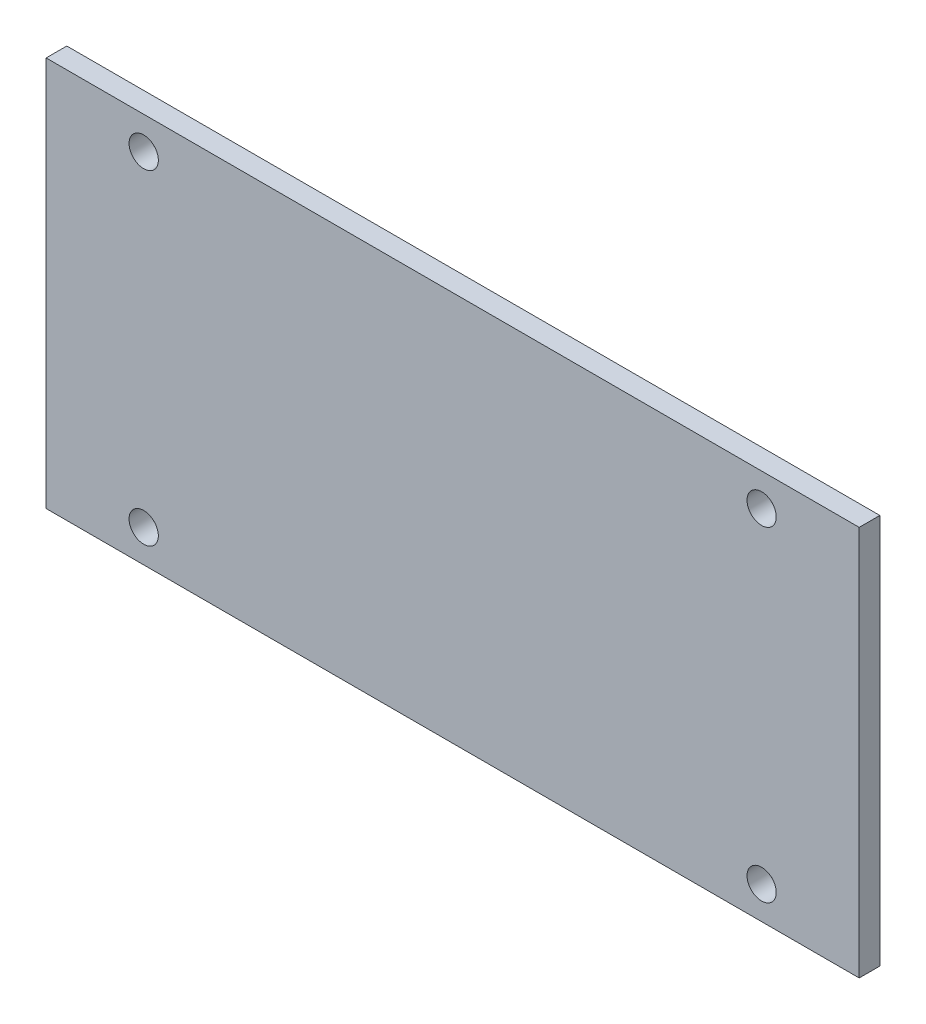
ISO-10303-21;
HEADER;
FILE_DESCRIPTION(('STEP AP214'),'2;1');
FILE_NAME('part.step','',(''),(''),'','','');
FILE_SCHEMA(('AUTOMOTIVE_DESIGN { 1 0 10303 214 1 1 1 1 }'));
ENDSEC;
DATA;
#1=APPLICATION_CONTEXT('core data for automotive mechanical design processes');
#2=APPLICATION_PROTOCOL_DEFINITION('international standard','automotive_design',2000,#1);
#3=PRODUCT_CONTEXT('',#1,'mechanical');
#4=PRODUCT('Part','Part','',(#3));
#5=PRODUCT_RELATED_PRODUCT_CATEGORY('part','',(#4));
#6=PRODUCT_DEFINITION_FORMATION('','',#4);
#7=PRODUCT_DEFINITION_CONTEXT('part definition',#1,'design');
#8=PRODUCT_DEFINITION('design','',#6,#7);
#9=PRODUCT_DEFINITION_SHAPE('','',#8);
#10=(LENGTH_UNIT() NAMED_UNIT(*) SI_UNIT(.MILLI.,.METRE.));
#11=(NAMED_UNIT(*) PLANE_ANGLE_UNIT() SI_UNIT($,.RADIAN.));
#12=(NAMED_UNIT(*) SI_UNIT($,.STERADIAN.) SOLID_ANGLE_UNIT());
#13=UNCERTAINTY_MEASURE_WITH_UNIT(LENGTH_MEASURE(1.E-05),#10,'distance_accuracy_value','');
#14=(GEOMETRIC_REPRESENTATION_CONTEXT(3) GLOBAL_UNCERTAINTY_ASSIGNED_CONTEXT((#13)) GLOBAL_UNIT_ASSIGNED_CONTEXT((#10,
#11,#12)) REPRESENTATION_CONTEXT('',''));
#15=CARTESIAN_POINT('',(0.,0.,0.));
#16=DIRECTION('',(0.,0.,1.));
#17=DIRECTION('',(1.,0.,0.));
#18=AXIS2_PLACEMENT_3D('',#15,#16,#17);
#19=CARTESIAN_POINT('',(-62.5,-30.,3.175));
#20=DIRECTION('',(1.,0.,0.));
#21=DIRECTION('',(0.,0.,-1.));
#22=AXIS2_PLACEMENT_3D('',#19,#20,#21);
#23=PLANE('',#22);
#24=DIRECTION('',(0.,-1.,0.));
#25=VECTOR('',#24,1.);
#26=CARTESIAN_POINT('',(-62.5,-30.,0.));
#27=LINE('',#26,#25);
#28=CARTESIAN_POINT('',(-62.5,30.,0.));
#29=VERTEX_POINT('',#28);
#30=CARTESIAN_POINT('',(-62.5,-30.,0.));
#31=VERTEX_POINT('',#30);
#32=EDGE_CURVE('E100',#29,#31,#27,.T.);
#33=ORIENTED_EDGE('',*,*,#32,.T.);
#34=DIRECTION('',(0.,0.,-1.));
#35=VECTOR('',#34,1.);
#36=CARTESIAN_POINT('',(-62.5,-30.,3.175));
#37=LINE('',#36,#35);
#38=CARTESIAN_POINT('',(-62.5,-30.,3.175));
#39=VERTEX_POINT('',#38);
#40=EDGE_CURVE('E11',#39,#31,#37,.T.);
#41=ORIENTED_EDGE('',*,*,#40,.F.);
#42=DIRECTION('',(0.,-1.,0.));
#43=VECTOR('',#42,1.);
#44=CARTESIAN_POINT('',(-62.5,-30.,3.175));
#45=LINE('',#44,#43);
#46=CARTESIAN_POINT('',(-62.5,30.,3.175));
#47=VERTEX_POINT('',#46);
#48=EDGE_CURVE('E88',#47,#39,#45,.T.);
#49=ORIENTED_EDGE('',*,*,#48,.F.);
#50=DIRECTION('',(0.,0.,-1.));
#51=VECTOR('',#50,1.);
#52=CARTESIAN_POINT('',(-62.5,30.,3.175));
#53=LINE('',#52,#51);
#54=EDGE_CURVE('E96',#47,#29,#53,.T.);
#55=ORIENTED_EDGE('',*,*,#54,.T.);
#56=EDGE_LOOP('',(#33,#41,#49,#55));
#57=FACE_BOUND('',#56,.T.);
#58=ADVANCED_FACE('F37',(#57),#23,.F.);
#59=CARTESIAN_POINT('',(62.5,-30.,3.175));
#60=DIRECTION('',(0.,1.,0.));
#61=DIRECTION('',(-1.,0.,0.));
#62=AXIS2_PLACEMENT_3D('',#59,#60,#61);
#63=PLANE('',#62);
#64=DIRECTION('',(1.,0.,0.));
#65=VECTOR('',#64,1.);
#66=CARTESIAN_POINT('',(62.5,-30.,0.));
#67=LINE('',#66,#65);
#68=CARTESIAN_POINT('',(62.5,-30.,0.));
#69=VERTEX_POINT('',#68);
#70=EDGE_CURVE('E92',#31,#69,#67,.T.);
#71=ORIENTED_EDGE('',*,*,#70,.T.);
#72=DIRECTION('',(0.,0.,-1.));
#73=VECTOR('',#72,1.);
#74=CARTESIAN_POINT('',(62.5,-30.,3.175));
#75=LINE('',#74,#73);
#76=CARTESIAN_POINT('',(62.5,-30.,3.175));
#77=VERTEX_POINT('',#76);
#78=EDGE_CURVE('E45',#77,#69,#75,.T.);
#79=ORIENTED_EDGE('',*,*,#78,.F.);
#80=DIRECTION('',(1.,0.,0.));
#81=VECTOR('',#80,1.);
#82=CARTESIAN_POINT('',(62.5,-30.,3.175));
#83=LINE('',#82,#81);
#84=EDGE_CURVE('E83',#39,#77,#83,.T.);
#85=ORIENTED_EDGE('',*,*,#84,.F.);
#86=ORIENTED_EDGE('',*,*,#40,.T.);
#87=EDGE_LOOP('',(#71,#79,#85,#86));
#88=FACE_BOUND('',#87,.T.);
#89=ADVANCED_FACE('F91',(#88),#63,.F.);
#90=CARTESIAN_POINT('',(62.5,-30.,3.175));
#91=DIRECTION('',(-1.,0.,0.));
#92=DIRECTION('',(0.,0.,1.));
#93=AXIS2_PLACEMENT_3D('',#90,#91,#92);
#94=PLANE('',#93);
#95=DIRECTION('',(0.,1.,0.));
#96=VECTOR('',#95,1.);
#97=CARTESIAN_POINT('',(62.5,-30.,0.));
#98=LINE('',#97,#96);
#99=CARTESIAN_POINT('',(62.5,30.,0.));
#100=VERTEX_POINT('',#99);
#101=EDGE_CURVE('E70',#69,#100,#98,.T.);
#102=ORIENTED_EDGE('',*,*,#101,.T.);
#103=DIRECTION('',(0.,0.,-1.));
#104=VECTOR('',#103,1.);
#105=CARTESIAN_POINT('',(62.5,30.,3.175));
#106=LINE('',#105,#104);
#107=CARTESIAN_POINT('',(62.5,30.,3.175));
#108=VERTEX_POINT('',#107);
#109=EDGE_CURVE('E93',#108,#100,#106,.T.);
#110=ORIENTED_EDGE('',*,*,#109,.F.);
#111=DIRECTION('',(0.,1.,0.));
#112=VECTOR('',#111,1.);
#113=CARTESIAN_POINT('',(62.5,-30.,3.175));
#114=LINE('',#113,#112);
#115=EDGE_CURVE('E86',#77,#108,#114,.T.);
#116=ORIENTED_EDGE('',*,*,#115,.F.);
#117=ORIENTED_EDGE('',*,*,#78,.T.);
#118=EDGE_LOOP('',(#102,#110,#116,#117));
#119=FACE_BOUND('',#118,.T.);
#120=ADVANCED_FACE('F94',(#119),#94,.F.);
#121=CARTESIAN_POINT('',(62.5,30.,3.175));
#122=DIRECTION('',(0.,-1.,0.));
#123=DIRECTION('',(1.,0.,0.));
#124=AXIS2_PLACEMENT_3D('',#121,#122,#123);
#125=PLANE('',#124);
#126=DIRECTION('',(-1.,0.,0.));
#127=VECTOR('',#126,1.);
#128=CARTESIAN_POINT('',(62.5,30.,0.));
#129=LINE('',#128,#127);
#130=EDGE_CURVE('E76',#100,#29,#129,.T.);
#131=ORIENTED_EDGE('',*,*,#130,.T.);
#132=ORIENTED_EDGE('',*,*,#54,.F.);
#133=DIRECTION('',(-1.,0.,0.));
#134=VECTOR('',#133,1.);
#135=CARTESIAN_POINT('',(62.5,30.,3.175));
#136=LINE('',#135,#134);
#137=EDGE_CURVE('E53',#108,#47,#136,.T.);
#138=ORIENTED_EDGE('',*,*,#137,.F.);
#139=ORIENTED_EDGE('',*,*,#109,.T.);
#140=EDGE_LOOP('',(#131,#132,#138,#139));
#141=FACE_BOUND('',#140,.T.);
#142=ADVANCED_FACE('F108',(#141),#125,.F.);
#143=CARTESIAN_POINT('',(0.,0.,3.175));
#144=DIRECTION('',(0.,0.,1.));
#145=DIRECTION('',(1.,0.,0.));
#146=AXIS2_PLACEMENT_3D('',#143,#144,#145);
#147=PLANE('',#146);
#148=CARTESIAN_POINT('',(47.5,25.,3.175));
#149=DIRECTION('',(0.,0.,1.));
#150=DIRECTION('',(-1.,0.,0.));
#151=AXIS2_PLACEMENT_3D('',#148,#149,#150);
#152=CIRCLE('',#151,2.25);
#153=CARTESIAN_POINT('',(45.25,25.,3.175));
#154=VERTEX_POINT('',#153);
#155=EDGE_CURVE('E120',#154,#154,#152,.T.);
#156=ORIENTED_EDGE('',*,*,#155,.F.);
#157=EDGE_LOOP('',(#156));
#158=FACE_BOUND('',#157,.T.);
#159=CARTESIAN_POINT('',(47.5,-25.,3.175));
#160=DIRECTION('',(0.,0.,1.));
#161=DIRECTION('',(-1.,0.,0.));
#162=AXIS2_PLACEMENT_3D('',#159,#160,#161);
#163=CIRCLE('',#162,2.25);
#164=CARTESIAN_POINT('',(45.25,-25.,3.175));
#165=VERTEX_POINT('',#164);
#166=EDGE_CURVE('E126',#165,#165,#163,.T.);
#167=ORIENTED_EDGE('',*,*,#166,.F.);
#168=EDGE_LOOP('',(#167));
#169=FACE_BOUND('',#168,.T.);
#170=CARTESIAN_POINT('',(-47.5,-25.,3.175));
#171=DIRECTION('',(0.,0.,1.));
#172=DIRECTION('',(1.,0.,0.));
#173=AXIS2_PLACEMENT_3D('',#170,#171,#172);
#174=CIRCLE('',#173,2.25);
#175=CARTESIAN_POINT('',(-45.25,-25.,3.175));
#176=VERTEX_POINT('',#175);
#177=EDGE_CURVE('E132',#176,#176,#174,.T.);
#178=ORIENTED_EDGE('',*,*,#177,.F.);
#179=EDGE_LOOP('',(#178));
#180=FACE_BOUND('',#179,.T.);
#181=CARTESIAN_POINT('',(-47.5,25.,3.175));
#182=DIRECTION('',(0.,0.,1.));
#183=DIRECTION('',(1.,0.,0.));
#184=AXIS2_PLACEMENT_3D('',#181,#182,#183);
#185=CIRCLE('',#184,2.25);
#186=CARTESIAN_POINT('',(-45.25,25.,3.175));
#187=VERTEX_POINT('',#186);
#188=EDGE_CURVE('E114',#187,#187,#185,.T.);
#189=ORIENTED_EDGE('',*,*,#188,.F.);
#190=EDGE_LOOP('',(#189));
#191=FACE_BOUND('',#190,.T.);
#192=ORIENTED_EDGE('',*,*,#48,.T.);
#193=ORIENTED_EDGE('',*,*,#84,.T.);
#194=ORIENTED_EDGE('',*,*,#115,.T.);
#195=ORIENTED_EDGE('',*,*,#137,.T.);
#196=EDGE_LOOP('',(#192,#193,#194,#195));
#197=FACE_BOUND('',#196,.T.);
#198=ADVANCED_FACE('F84',(#158,#169,#180,#191,#197),#147,.T.);
#199=CARTESIAN_POINT('',(0.,0.,0.));
#200=DIRECTION('',(0.,0.,1.));
#201=DIRECTION('',(1.,0.,0.));
#202=AXIS2_PLACEMENT_3D('',#199,#200,#201);
#203=PLANE('',#202);
#204=CARTESIAN_POINT('',(47.5,25.,0.));
#205=DIRECTION('',(0.,0.,1.));
#206=DIRECTION('',(-1.,0.,0.));
#207=AXIS2_PLACEMENT_3D('',#204,#205,#206);
#208=CIRCLE('',#207,2.25);
#209=CARTESIAN_POINT('',(45.25,25.,0.));
#210=VERTEX_POINT('',#209);
#211=EDGE_CURVE('E123',#210,#210,#208,.T.);
#212=ORIENTED_EDGE('',*,*,#211,.T.);
#213=EDGE_LOOP('',(#212));
#214=FACE_BOUND('',#213,.T.);
#215=CARTESIAN_POINT('',(47.5,-25.,0.));
#216=DIRECTION('',(0.,0.,1.));
#217=DIRECTION('',(-1.,0.,0.));
#218=AXIS2_PLACEMENT_3D('',#215,#216,#217);
#219=CIRCLE('',#218,2.25);
#220=CARTESIAN_POINT('',(45.25,-25.,0.));
#221=VERTEX_POINT('',#220);
#222=EDGE_CURVE('E129',#221,#221,#219,.T.);
#223=ORIENTED_EDGE('',*,*,#222,.T.);
#224=EDGE_LOOP('',(#223));
#225=FACE_BOUND('',#224,.T.);
#226=CARTESIAN_POINT('',(-47.5,-25.,0.));
#227=DIRECTION('',(0.,0.,1.));
#228=DIRECTION('',(1.,0.,0.));
#229=AXIS2_PLACEMENT_3D('',#226,#227,#228);
#230=CIRCLE('',#229,2.25);
#231=CARTESIAN_POINT('',(-45.25,-25.,0.));
#232=VERTEX_POINT('',#231);
#233=EDGE_CURVE('E117',#232,#232,#230,.T.);
#234=ORIENTED_EDGE('',*,*,#233,.T.);
#235=EDGE_LOOP('',(#234));
#236=FACE_BOUND('',#235,.T.);
#237=CARTESIAN_POINT('',(-47.5,25.,0.));
#238=DIRECTION('',(0.,0.,1.));
#239=DIRECTION('',(1.,0.,0.));
#240=AXIS2_PLACEMENT_3D('',#237,#238,#239);
#241=CIRCLE('',#240,2.25);
#242=CARTESIAN_POINT('',(-45.25,25.,0.));
#243=VERTEX_POINT('',#242);
#244=EDGE_CURVE('E103',#243,#243,#241,.T.);
#245=ORIENTED_EDGE('',*,*,#244,.T.);
#246=EDGE_LOOP('',(#245));
#247=FACE_BOUND('',#246,.T.);
#248=ORIENTED_EDGE('',*,*,#32,.F.);
#249=ORIENTED_EDGE('',*,*,#130,.F.);
#250=ORIENTED_EDGE('',*,*,#101,.F.);
#251=ORIENTED_EDGE('',*,*,#70,.F.);
#252=EDGE_LOOP('',(#248,#249,#250,#251));
#253=FACE_BOUND('',#252,.T.);
#254=ADVANCED_FACE('F111',(#214,#225,#236,#247,#253),#203,.F.);
#255=CARTESIAN_POINT('',(-47.5,25.,0.));
#256=DIRECTION('',(0.,0.,1.));
#257=DIRECTION('',(1.,0.,0.));
#258=AXIS2_PLACEMENT_3D('',#255,#256,#257);
#259=CYLINDRICAL_SURFACE('',#258,2.25);
#260=ORIENTED_EDGE('',*,*,#244,.F.);
#261=EDGE_LOOP('',(#260));
#262=FACE_BOUND('',#261,.T.);
#263=ORIENTED_EDGE('',*,*,#188,.T.);
#264=EDGE_LOOP('',(#263));
#265=FACE_BOUND('',#264,.T.);
#266=ADVANCED_FACE('F144',(#262,#265),#259,.F.);
#267=CARTESIAN_POINT('',(-47.5,-25.,0.));
#268=DIRECTION('',(0.,0.,1.));
#269=DIRECTION('',(1.,0.,0.));
#270=AXIS2_PLACEMENT_3D('',#267,#268,#269);
#271=CYLINDRICAL_SURFACE('',#270,2.25);
#272=ORIENTED_EDGE('',*,*,#233,.F.);
#273=EDGE_LOOP('',(#272));
#274=FACE_BOUND('',#273,.T.);
#275=ORIENTED_EDGE('',*,*,#177,.T.);
#276=EDGE_LOOP('',(#275));
#277=FACE_BOUND('',#276,.T.);
#278=ADVANCED_FACE('F140',(#274,#277),#271,.F.);
#279=CARTESIAN_POINT('',(47.5,-25.,0.));
#280=DIRECTION('',(0.,0.,1.));
#281=DIRECTION('',(1.,0.,0.));
#282=AXIS2_PLACEMENT_3D('',#279,#280,#281);
#283=CYLINDRICAL_SURFACE('',#282,2.25);
#284=ORIENTED_EDGE('',*,*,#222,.F.);
#285=EDGE_LOOP('',(#284));
#286=FACE_BOUND('',#285,.T.);
#287=ORIENTED_EDGE('',*,*,#166,.T.);
#288=EDGE_LOOP('',(#287));
#289=FACE_BOUND('',#288,.T.);
#290=ADVANCED_FACE('F143',(#286,#289),#283,.F.);
#291=CARTESIAN_POINT('',(47.5,25.,0.));
#292=DIRECTION('',(0.,0.,1.));
#293=DIRECTION('',(1.,0.,0.));
#294=AXIS2_PLACEMENT_3D('',#291,#292,#293);
#295=CYLINDRICAL_SURFACE('',#294,2.25);
#296=ORIENTED_EDGE('',*,*,#211,.F.);
#297=EDGE_LOOP('',(#296));
#298=FACE_BOUND('',#297,.T.);
#299=ORIENTED_EDGE('',*,*,#155,.T.);
#300=EDGE_LOOP('',(#299));
#301=FACE_BOUND('',#300,.T.);
#302=ADVANCED_FACE('F205',(#298,#301),#295,.F.);
#303=CLOSED_SHELL('',(#58,#89,#120,#142,#198,#254,#266,#278,#290,#302));
#304=MANIFOLD_SOLID_BREP('B2',#303);
#305=ADVANCED_BREP_SHAPE_REPRESENTATION('',(#18,#304),#14);
#306=SHAPE_DEFINITION_REPRESENTATION(#9,#305);
ENDSEC;
END-ISO-10303-21;
